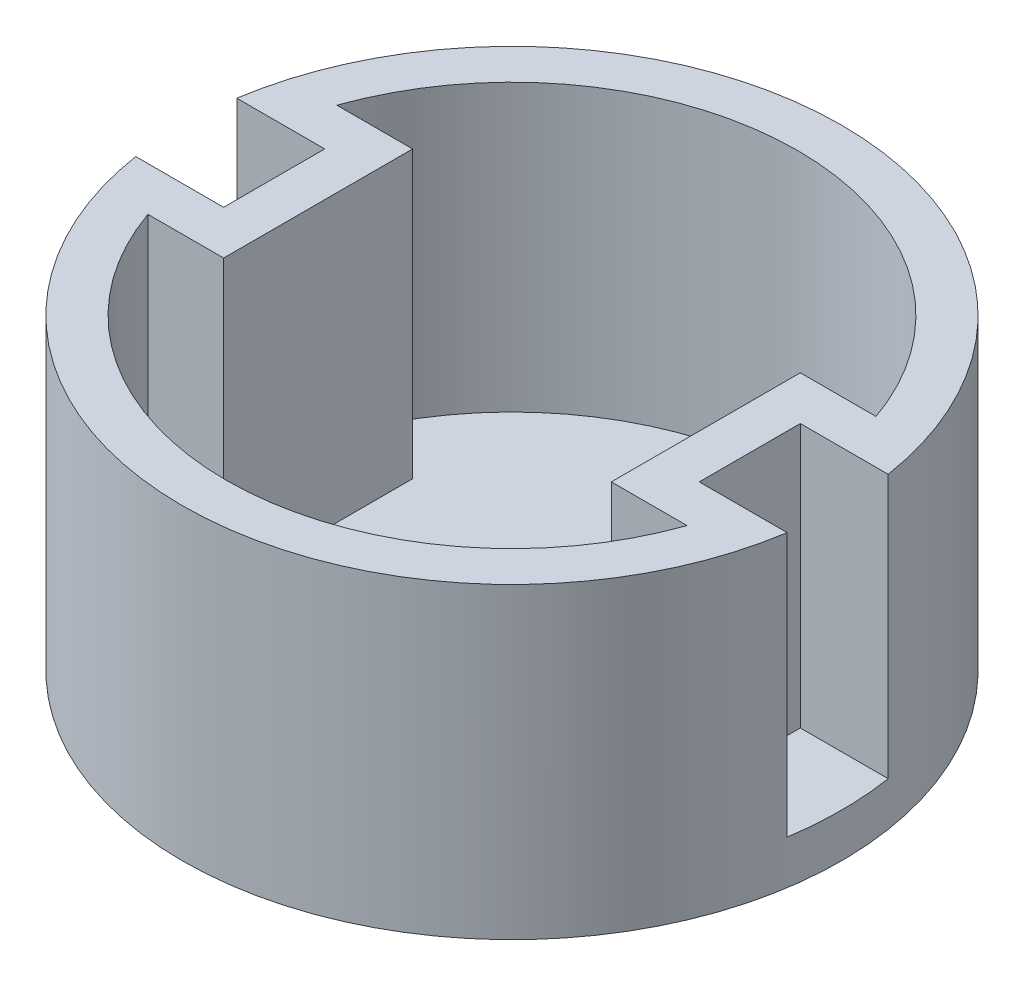
ISO-10303-21;
HEADER;
FILE_DESCRIPTION(('STEP AP214'),'2;1');
FILE_NAME('part.step','',(''),(''),'','','');
FILE_SCHEMA(('AUTOMOTIVE_DESIGN { 1 0 10303 214 1 1 1 1 }'));
ENDSEC;
DATA;
#1=APPLICATION_CONTEXT('core data for automotive mechanical design processes');
#2=APPLICATION_PROTOCOL_DEFINITION('international standard','automotive_design',2000,#1);
#3=PRODUCT_CONTEXT('',#1,'mechanical');
#4=PRODUCT('Part','Part','',(#3));
#5=PRODUCT_RELATED_PRODUCT_CATEGORY('part','',(#4));
#6=PRODUCT_DEFINITION_FORMATION('','',#4);
#7=PRODUCT_DEFINITION_CONTEXT('part definition',#1,'design');
#8=PRODUCT_DEFINITION('design','',#6,#7);
#9=PRODUCT_DEFINITION_SHAPE('','',#8);
#10=(LENGTH_UNIT() NAMED_UNIT(*) SI_UNIT(.MILLI.,.METRE.));
#11=(NAMED_UNIT(*) PLANE_ANGLE_UNIT() SI_UNIT($,.RADIAN.));
#12=(NAMED_UNIT(*) SI_UNIT($,.STERADIAN.) SOLID_ANGLE_UNIT());
#13=UNCERTAINTY_MEASURE_WITH_UNIT(LENGTH_MEASURE(1.E-05),#10,'distance_accuracy_value','');
#14=(GEOMETRIC_REPRESENTATION_CONTEXT(3) GLOBAL_UNCERTAINTY_ASSIGNED_CONTEXT((#13)) GLOBAL_UNIT_ASSIGNED_CONTEXT((#10,
#11,#12)) REPRESENTATION_CONTEXT('',''));
#15=CARTESIAN_POINT('',(0.,0.,0.));
#16=DIRECTION('',(0.,0.,1.));
#17=DIRECTION('',(1.,0.,0.));
#18=AXIS2_PLACEMENT_3D('',#15,#16,#17);
#19=CARTESIAN_POINT('',(-19.143760262746,5.,-2.85119833700473));
#20=DIRECTION('',(0.,1.,0.));
#21=DIRECTION('',(0.,0.,1.));
#22=AXIS2_PLACEMENT_3D('',#19,#20,#21);
#23=CYLINDRICAL_SURFACE('',#22,65.);
#24=DIRECTION('',(0.,-1.,0.));
#25=VECTOR('',#24,1.);
#26=CARTESIAN_POINT('',(42.1974982831952,70.,-24.3511983370047));
#27=LINE('',#26,#25);
#28=CARTESIAN_POINT('',(42.1974982831952,70.,-24.3511983370047));
#29=VERTEX_POINT('',#28);
#30=CARTESIAN_POINT('',(42.1974982831952,5.,-24.3511983370047));
#31=VERTEX_POINT('',#30);
#32=EDGE_CURVE('E136',#29,#31,#27,.T.);
#33=ORIENTED_EDGE('',*,*,#32,.F.);
#34=CARTESIAN_POINT('',(-19.143760262746,70.,-2.85119833700473));
#35=DIRECTION('',(0.,1.,0.));
#36=DIRECTION('',(0.,0.,1.));
#37=AXIS2_PLACEMENT_3D('',#34,#35,#36);
#38=CIRCLE('',#37,65.);
#39=CARTESIAN_POINT('',(-80.4850188086872,70.,-24.3511983370047));
#40=VERTEX_POINT('',#39);
#41=EDGE_CURVE('E247',#29,#40,#38,.T.);
#42=ORIENTED_EDGE('',*,*,#41,.T.);
#43=DIRECTION('',(0.,-1.,0.));
#44=VECTOR('',#43,1.);
#45=CARTESIAN_POINT('',(-80.4850188086872,70.,-24.3511983370047));
#46=LINE('',#45,#44);
#47=CARTESIAN_POINT('',(-80.4850188086872,5.,-24.3511983370047));
#48=VERTEX_POINT('',#47);
#49=EDGE_CURVE('E305',#40,#48,#46,.T.);
#50=ORIENTED_EDGE('',*,*,#49,.T.);
#51=CARTESIAN_POINT('',(-19.143760262746,5.,-2.85119833700473));
#52=DIRECTION('',(0.,1.,0.));
#53=DIRECTION('',(0.,0.,1.));
#54=AXIS2_PLACEMENT_3D('',#51,#52,#53);
#55=CIRCLE('',#54,65.);
#56=EDGE_CURVE('E364',#31,#48,#55,.T.);
#57=ORIENTED_EDGE('',*,*,#56,.F.);
#58=EDGE_LOOP('',(#33,#42,#50,#57));
#59=FACE_BOUND('',#58,.T.);
#60=ADVANCED_FACE('F111',(#59),#23,.F.);
#61=CARTESIAN_POINT('',(0.,5.,0.));
#62=DIRECTION('',(0.,1.,0.));
#63=DIRECTION('',(0.,0.,1.));
#64=AXIS2_PLACEMENT_3D('',#61,#62,#63);
#65=PLANE('',#64);
#66=DIRECTION('',(0.,0.,1.));
#67=VECTOR('',#66,1.);
#68=CARTESIAN_POINT('',(24.9693289995429,5.,0.));
#69=LINE('',#68,#67);
#70=CARTESIAN_POINT('',(24.9693289995429,5.,-24.3511983370047));
#71=VERTEX_POINT('',#70);
#72=CARTESIAN_POINT('',(24.9693289995429,5.,18.6488016629953));
#73=VERTEX_POINT('',#72);
#74=EDGE_CURVE('E388',#71,#73,#69,.T.);
#75=ORIENTED_EDGE('',*,*,#74,.F.);
#76=DIRECTION('',(-1.,0.,0.));
#77=VECTOR('',#76,1.);
#78=CARTESIAN_POINT('',(0.,5.,-24.3511983370047));
#79=LINE('',#78,#77);
#80=EDGE_CURVE('E253',#31,#71,#79,.T.);
#81=ORIENTED_EDGE('',*,*,#80,.F.);
#82=ORIENTED_EDGE('',*,*,#56,.T.);
#83=DIRECTION('',(1.,0.,0.));
#84=VECTOR('',#83,1.);
#85=CARTESIAN_POINT('',(0.,5.,-24.3511983370047));
#86=LINE('',#85,#84);
#87=CARTESIAN_POINT('',(-63.2568495250349,5.,-24.3511983370047));
#88=VERTEX_POINT('',#87);
#89=EDGE_CURVE('E255',#48,#88,#86,.T.);
#90=ORIENTED_EDGE('',*,*,#89,.T.);
#91=DIRECTION('',(0.,0.,1.));
#92=VECTOR('',#91,1.);
#93=CARTESIAN_POINT('',(-63.2568495250349,5.,0.));
#94=LINE('',#93,#92);
#95=CARTESIAN_POINT('',(-63.2568495250349,5.,18.6488016629953));
#96=VERTEX_POINT('',#95);
#97=EDGE_CURVE('E271',#88,#96,#94,.T.);
#98=ORIENTED_EDGE('',*,*,#97,.T.);
#99=DIRECTION('',(1.,0.,0.));
#100=VECTOR('',#99,1.);
#101=CARTESIAN_POINT('',(0.,5.,18.6488016629953));
#102=LINE('',#101,#100);
#103=CARTESIAN_POINT('',(-80.4850188086872,5.,18.6488016629953));
#104=VERTEX_POINT('',#103);
#105=EDGE_CURVE('E260',#104,#96,#102,.T.);
#106=ORIENTED_EDGE('',*,*,#105,.F.);
#107=CARTESIAN_POINT('',(42.1974982831952,5.,18.6488016629953));
#108=VERTEX_POINT('',#107);
#109=EDGE_CURVE('E367',#104,#108,#55,.T.);
#110=ORIENTED_EDGE('',*,*,#109,.T.);
#111=DIRECTION('',(-1.,0.,0.));
#112=VECTOR('',#111,1.);
#113=CARTESIAN_POINT('',(0.,5.,18.6488016629953));
#114=LINE('',#113,#112);
#115=EDGE_CURVE('E250',#108,#73,#114,.T.);
#116=ORIENTED_EDGE('',*,*,#115,.T.);
#117=EDGE_LOOP('',(#75,#81,#82,#90,#98,#106,#110,#116));
#118=FACE_BOUND('',#117,.T.);
#119=ADVANCED_FACE('F384',(#118),#65,.T.);
#120=CARTESIAN_POINT('',(-80.4850188086872,70.,18.6488016629953));
#121=VERTEX_POINT('',#120);
#122=CARTESIAN_POINT('',(42.1974982831952,70.,18.6488016629953));
#123=VERTEX_POINT('',#122);
#124=EDGE_CURVE('E128',#121,#123,#38,.T.);
#125=ORIENTED_EDGE('',*,*,#124,.T.);
#126=DIRECTION('',(0.,-1.,0.));
#127=VECTOR('',#126,1.);
#128=CARTESIAN_POINT('',(42.1974982831952,70.,18.6488016629953));
#129=LINE('',#128,#127);
#130=EDGE_CURVE('E262',#123,#108,#129,.T.);
#131=ORIENTED_EDGE('',*,*,#130,.T.);
#132=ORIENTED_EDGE('',*,*,#109,.F.);
#133=DIRECTION('',(0.,-1.,0.));
#134=VECTOR('',#133,1.);
#135=CARTESIAN_POINT('',(-80.4850188086872,70.,18.6488016629953));
#136=LINE('',#135,#134);
#137=EDGE_CURVE('E294',#121,#104,#136,.T.);
#138=ORIENTED_EDGE('',*,*,#137,.F.);
#139=EDGE_LOOP('',(#125,#131,#132,#138));
#140=FACE_BOUND('',#139,.T.);
#141=ADVANCED_FACE('F405',(#140),#23,.F.);
#142=CARTESIAN_POINT('',(-19.143760262746,70.,-2.85119833700473));
#143=DIRECTION('',(0.,-1.,0.));
#144=DIRECTION('',(0.,0.,-1.));
#145=AXIS2_PLACEMENT_3D('',#142,#143,#144);
#146=CYLINDRICAL_SURFACE('',#145,75.);
#147=CARTESIAN_POINT('',(-19.143760262746,0.,-2.85119833700473));
#148=DIRECTION('',(0.,1.,0.));
#149=DIRECTION('',(0.,0.,1.));
#150=AXIS2_PLACEMENT_3D('',#147,#148,#149);
#151=CIRCLE('',#150,75.);
#152=CARTESIAN_POINT('',(-19.143760262746,0.,72.1488016629953));
#153=VERTEX_POINT('',#152);
#154=EDGE_CURVE('E115',#153,#153,#151,.T.);
#155=ORIENTED_EDGE('',*,*,#154,.T.);
#156=EDGE_LOOP('',(#155));
#157=FACE_BOUND('',#156,.T.);
#158=DIRECTION('',(0.,-1.,0.));
#159=VECTOR('',#158,1.);
#160=CARTESIAN_POINT('',(-93.2568495250349,70.,-14.3511983370047));
#161=LINE('',#160,#159);
#162=CARTESIAN_POINT('',(-93.2568495250349,70.,-14.3511983370047));
#163=VERTEX_POINT('',#162);
#164=CARTESIAN_POINT('',(-93.2568495250349,10.,-14.3511983370047));
#165=VERTEX_POINT('',#164);
#166=EDGE_CURVE('E354',#163,#165,#161,.T.);
#167=ORIENTED_EDGE('',*,*,#166,.F.);
#168=CARTESIAN_POINT('',(-19.143760262746,70.,-2.85119833700473));
#169=DIRECTION('',(0.,1.,0.));
#170=DIRECTION('',(0.,0.,1.));
#171=AXIS2_PLACEMENT_3D('',#168,#169,#170);
#172=CIRCLE('',#171,75.);
#173=CARTESIAN_POINT('',(54.9693289995429,70.,-14.3511983370047));
#174=VERTEX_POINT('',#173);
#175=EDGE_CURVE('E12',#174,#163,#172,.T.);
#176=ORIENTED_EDGE('',*,*,#175,.F.);
#177=DIRECTION('',(0.,-1.,0.));
#178=VECTOR('',#177,1.);
#179=CARTESIAN_POINT('',(54.9693289995429,70.,-14.3511983370047));
#180=LINE('',#179,#178);
#181=CARTESIAN_POINT('',(54.9693289995429,10.,-14.3511983370047));
#182=VERTEX_POINT('',#181);
#183=EDGE_CURVE('E347',#174,#182,#180,.T.);
#184=ORIENTED_EDGE('',*,*,#183,.T.);
#185=CARTESIAN_POINT('',(-19.143760262746,10.,-2.85119833700473));
#186=DIRECTION('',(0.,1.,0.));
#187=DIRECTION('',(0.,0.,1.));
#188=AXIS2_PLACEMENT_3D('',#185,#186,#187);
#189=CIRCLE('',#188,75.);
#190=CARTESIAN_POINT('',(54.9693289995429,10.,8.64880166299527));
#191=VERTEX_POINT('',#190);
#192=EDGE_CURVE('E321',#191,#182,#189,.T.);
#193=ORIENTED_EDGE('',*,*,#192,.F.);
#194=DIRECTION('',(0.,-1.,0.));
#195=VECTOR('',#194,1.);
#196=CARTESIAN_POINT('',(54.9693289995429,70.,8.64880166299527));
#197=LINE('',#196,#195);
#198=CARTESIAN_POINT('',(54.9693289995429,70.,8.64880166299527));
#199=VERTEX_POINT('',#198);
#200=EDGE_CURVE('E361',#199,#191,#197,.T.);
#201=ORIENTED_EDGE('',*,*,#200,.F.);
#202=CARTESIAN_POINT('',(-93.2568495250349,70.,8.64880166299527));
#203=VERTEX_POINT('',#202);
#204=EDGE_CURVE('E121',#203,#199,#172,.T.);
#205=ORIENTED_EDGE('',*,*,#204,.F.);
#206=DIRECTION('',(0.,-1.,0.));
#207=VECTOR('',#206,1.);
#208=CARTESIAN_POINT('',(-93.2568495250349,70.,8.64880166299527));
#209=LINE('',#208,#207);
#210=CARTESIAN_POINT('',(-93.2568495250349,10.,8.64880166299527));
#211=VERTEX_POINT('',#210);
#212=EDGE_CURVE('E357',#203,#211,#209,.T.);
#213=ORIENTED_EDGE('',*,*,#212,.T.);
#214=CARTESIAN_POINT('',(-19.143760262746,10.,-2.85119833700473));
#215=DIRECTION('',(0.,1.,0.));
#216=DIRECTION('',(0.,0.,1.));
#217=AXIS2_PLACEMENT_3D('',#214,#215,#216);
#218=CIRCLE('',#217,75.);
#219=EDGE_CURVE('E351',#165,#211,#218,.T.);
#220=ORIENTED_EDGE('',*,*,#219,.F.);
#221=EDGE_LOOP('',(#167,#176,#184,#193,#201,#205,#213,#220));
#222=FACE_BOUND('',#221,.T.);
#223=ADVANCED_FACE('F113',(#157,#222),#146,.T.);
#224=CARTESIAN_POINT('',(-19.143760262746,70.,-2.85119833700473));
#225=DIRECTION('',(0.,1.,0.));
#226=DIRECTION('',(0.,0.,1.));
#227=AXIS2_PLACEMENT_3D('',#224,#225,#226);
#228=PLANE('',#227);
#229=DIRECTION('',(1.,0.,0.));
#230=VECTOR('',#229,1.);
#231=CARTESIAN_POINT('',(54.9693289995429,70.,8.64880166299527));
#232=LINE('',#231,#230);
#233=CARTESIAN_POINT('',(34.9693289995429,70.,8.64880166299528));
#234=VERTEX_POINT('',#233);
#235=EDGE_CURVE('E325',#234,#199,#232,.T.);
#236=ORIENTED_EDGE('',*,*,#235,.F.);
#237=DIRECTION('',(0.,0.,1.));
#238=VECTOR('',#237,1.);
#239=CARTESIAN_POINT('',(34.9693289995429,70.,0.));
#240=LINE('',#239,#238);
#241=CARTESIAN_POINT('',(34.9693289995429,70.,-14.3511983370047));
#242=VERTEX_POINT('',#241);
#243=EDGE_CURVE('E397',#242,#234,#240,.T.);
#244=ORIENTED_EDGE('',*,*,#243,.F.);
#245=DIRECTION('',(1.,0.,0.));
#246=VECTOR('',#245,1.);
#247=CARTESIAN_POINT('',(54.9693289995429,70.,-14.3511983370047));
#248=LINE('',#247,#246);
#249=EDGE_CURVE('E328',#242,#174,#248,.T.);
#250=ORIENTED_EDGE('',*,*,#249,.T.);
#251=ORIENTED_EDGE('',*,*,#175,.T.);
#252=DIRECTION('',(1.,0.,0.));
#253=VECTOR('',#252,1.);
#254=CARTESIAN_POINT('',(0.,70.,-14.3511983370047));
#255=LINE('',#254,#253);
#256=CARTESIAN_POINT('',(-73.2568495250349,70.,-14.3511983370047));
#257=VERTEX_POINT('',#256);
#258=EDGE_CURVE('E322',#163,#257,#255,.T.);
#259=ORIENTED_EDGE('',*,*,#258,.T.);
#260=DIRECTION('',(0.,0.,-1.));
#261=VECTOR('',#260,1.);
#262=CARTESIAN_POINT('',(-73.2568495250349,70.,0.));
#263=LINE('',#262,#261);
#264=CARTESIAN_POINT('',(-73.2568495250349,70.,8.64880166299527));
#265=VERTEX_POINT('',#264);
#266=EDGE_CURVE('E270',#265,#257,#263,.T.);
#267=ORIENTED_EDGE('',*,*,#266,.F.);
#268=DIRECTION('',(1.,0.,0.));
#269=VECTOR('',#268,1.);
#270=CARTESIAN_POINT('',(0.,70.,8.64880166299527));
#271=LINE('',#270,#269);
#272=EDGE_CURVE('E314',#203,#265,#271,.T.);
#273=ORIENTED_EDGE('',*,*,#272,.F.);
#274=ORIENTED_EDGE('',*,*,#204,.T.);
#275=EDGE_LOOP('',(#236,#244,#250,#251,#259,#267,#273,#274));
#276=FACE_BOUND('',#275,.T.);
#277=DIRECTION('',(-1.,0.,0.));
#278=VECTOR('',#277,1.);
#279=CARTESIAN_POINT('',(0.,70.,18.6488016629953));
#280=LINE('',#279,#278);
#281=CARTESIAN_POINT('',(24.9693289995429,70.,18.6488016629953));
#282=VERTEX_POINT('',#281);
#283=EDGE_CURVE('E241',#123,#282,#280,.T.);
#284=ORIENTED_EDGE('',*,*,#283,.F.);
#285=ORIENTED_EDGE('',*,*,#124,.F.);
#286=DIRECTION('',(1.,0.,0.));
#287=VECTOR('',#286,1.);
#288=CARTESIAN_POINT('',(0.,70.,18.6488016629953));
#289=LINE('',#288,#287);
#290=CARTESIAN_POINT('',(-63.2568495250349,70.,18.6488016629953));
#291=VERTEX_POINT('',#290);
#292=EDGE_CURVE('E275',#121,#291,#289,.T.);
#293=ORIENTED_EDGE('',*,*,#292,.T.);
#294=DIRECTION('',(0.,0.,1.));
#295=VECTOR('',#294,1.);
#296=CARTESIAN_POINT('',(-63.2568495250349,70.,0.));
#297=LINE('',#296,#295);
#298=CARTESIAN_POINT('',(-63.2568495250349,70.,-24.3511983370047));
#299=VERTEX_POINT('',#298);
#300=EDGE_CURVE('E278',#299,#291,#297,.T.);
#301=ORIENTED_EDGE('',*,*,#300,.F.);
#302=DIRECTION('',(1.,0.,0.));
#303=VECTOR('',#302,1.);
#304=CARTESIAN_POINT('',(0.,70.,-24.3511983370047));
#305=LINE('',#304,#303);
#306=EDGE_CURVE('E266',#40,#299,#305,.T.);
#307=ORIENTED_EDGE('',*,*,#306,.F.);
#308=ORIENTED_EDGE('',*,*,#41,.F.);
#309=DIRECTION('',(-1.,0.,0.));
#310=VECTOR('',#309,1.);
#311=CARTESIAN_POINT('',(0.,70.,-24.3511983370047));
#312=LINE('',#311,#310);
#313=CARTESIAN_POINT('',(24.9693289995429,70.,-24.3511983370047));
#314=VERTEX_POINT('',#313);
#315=EDGE_CURVE('E242',#29,#314,#312,.T.);
#316=ORIENTED_EDGE('',*,*,#315,.T.);
#317=DIRECTION('',(0.,0.,1.));
#318=VECTOR('',#317,1.);
#319=CARTESIAN_POINT('',(24.9693289995429,70.,0.));
#320=LINE('',#319,#318);
#321=EDGE_CURVE('E228',#314,#282,#320,.T.);
#322=ORIENTED_EDGE('',*,*,#321,.T.);
#323=EDGE_LOOP('',(#284,#285,#293,#301,#307,#308,#316,#322));
#324=FACE_BOUND('',#323,.T.);
#325=ADVANCED_FACE('F245',(#276,#324),#228,.T.);
#326=CARTESIAN_POINT('',(-19.143760262746,0.,-2.85119833700473));
#327=DIRECTION('',(0.,1.,0.));
#328=DIRECTION('',(0.,0.,1.));
#329=AXIS2_PLACEMENT_3D('',#326,#327,#328);
#330=PLANE('',#329);
#331=ORIENTED_EDGE('',*,*,#154,.F.);
#332=EDGE_LOOP('',(#331));
#333=FACE_BOUND('',#332,.T.);
#334=ADVANCED_FACE('F581',(#333),#330,.F.);
#335=CARTESIAN_POINT('',(0.,10.,8.64880166299528));
#336=DIRECTION('',(0.,0.,-1.));
#337=DIRECTION('',(-1.,0.,0.));
#338=AXIS2_PLACEMENT_3D('',#335,#336,#337);
#339=PLANE('',#338);
#340=ORIENTED_EDGE('',*,*,#200,.T.);
#341=DIRECTION('',(1.,0.,0.));
#342=VECTOR('',#341,1.);
#343=CARTESIAN_POINT('',(54.9693289995429,10.,8.64880166299527));
#344=LINE('',#343,#342);
#345=CARTESIAN_POINT('',(34.9693289995429,10.,8.64880166299528));
#346=VERTEX_POINT('',#345);
#347=EDGE_CURVE('E332',#346,#191,#344,.T.);
#348=ORIENTED_EDGE('',*,*,#347,.F.);
#349=DIRECTION('',(0.,-1.,0.));
#350=VECTOR('',#349,1.);
#351=CARTESIAN_POINT('',(34.9693289995429,70.,8.64880166299528));
#352=LINE('',#351,#350);
#353=EDGE_CURVE('E401',#234,#346,#352,.T.);
#354=ORIENTED_EDGE('',*,*,#353,.F.);
#355=ORIENTED_EDGE('',*,*,#235,.T.);
#356=EDGE_LOOP('',(#340,#348,#354,#355));
#357=FACE_BOUND('',#356,.T.);
#358=ADVANCED_FACE('F577',(#357),#339,.T.);
#359=CARTESIAN_POINT('',(0.,10.,-14.3511983370047));
#360=DIRECTION('',(0.,0.,-1.));
#361=DIRECTION('',(-1.,0.,0.));
#362=AXIS2_PLACEMENT_3D('',#359,#360,#361);
#363=PLANE('',#362);
#364=ORIENTED_EDGE('',*,*,#249,.F.);
#365=DIRECTION('',(0.,-1.,0.));
#366=VECTOR('',#365,1.);
#367=CARTESIAN_POINT('',(34.9693289995429,70.,-14.3511983370047));
#368=LINE('',#367,#366);
#369=CARTESIAN_POINT('',(34.9693289995429,10.,-14.3511983370047));
#370=VERTEX_POINT('',#369);
#371=EDGE_CURVE('E396',#242,#370,#368,.T.);
#372=ORIENTED_EDGE('',*,*,#371,.T.);
#373=DIRECTION('',(1.,0.,0.));
#374=VECTOR('',#373,1.);
#375=CARTESIAN_POINT('',(54.9693289995429,10.,-14.3511983370047));
#376=LINE('',#375,#374);
#377=EDGE_CURVE('E335',#370,#182,#376,.T.);
#378=ORIENTED_EDGE('',*,*,#377,.T.);
#379=ORIENTED_EDGE('',*,*,#183,.F.);
#380=EDGE_LOOP('',(#364,#372,#378,#379));
#381=FACE_BOUND('',#380,.T.);
#382=ADVANCED_FACE('F580',(#381),#363,.F.);
#383=CARTESIAN_POINT('',(0.,10.,0.));
#384=DIRECTION('',(0.,1.,0.));
#385=DIRECTION('',(0.,0.,1.));
#386=AXIS2_PLACEMENT_3D('',#383,#384,#385);
#387=PLANE('',#386);
#388=ORIENTED_EDGE('',*,*,#192,.T.);
#389=ORIENTED_EDGE('',*,*,#377,.F.);
#390=DIRECTION('',(0.,0.,1.));
#391=VECTOR('',#390,1.);
#392=CARTESIAN_POINT('',(34.9693289995429,10.,0.));
#393=LINE('',#392,#391);
#394=EDGE_CURVE('E309',#370,#346,#393,.T.);
#395=ORIENTED_EDGE('',*,*,#394,.T.);
#396=ORIENTED_EDGE('',*,*,#347,.T.);
#397=EDGE_LOOP('',(#388,#389,#395,#396));
#398=FACE_BOUND('',#397,.T.);
#399=ADVANCED_FACE('F473',(#398),#387,.T.);
#400=CARTESIAN_POINT('',(0.,10.,8.64880166299527));
#401=DIRECTION('',(0.,0.,1.));
#402=DIRECTION('',(1.,0.,0.));
#403=AXIS2_PLACEMENT_3D('',#400,#401,#402);
#404=PLANE('',#403);
#405=ORIENTED_EDGE('',*,*,#272,.T.);
#406=DIRECTION('',(0.,-1.,0.));
#407=VECTOR('',#406,1.);
#408=CARTESIAN_POINT('',(-73.2568495250349,70.,8.64880166299527));
#409=LINE('',#408,#407);
#410=CARTESIAN_POINT('',(-73.2568495250349,10.,8.64880166299527));
#411=VERTEX_POINT('',#410);
#412=EDGE_CURVE('E297',#265,#411,#409,.T.);
#413=ORIENTED_EDGE('',*,*,#412,.T.);
#414=DIRECTION('',(1.,0.,0.));
#415=VECTOR('',#414,1.);
#416=CARTESIAN_POINT('',(0.,10.,8.64880166299527));
#417=LINE('',#416,#415);
#418=EDGE_CURVE('E313',#211,#411,#417,.T.);
#419=ORIENTED_EDGE('',*,*,#418,.F.);
#420=ORIENTED_EDGE('',*,*,#212,.F.);
#421=EDGE_LOOP('',(#405,#413,#419,#420));
#422=FACE_BOUND('',#421,.T.);
#423=ADVANCED_FACE('F454',(#422),#404,.F.);
#424=CARTESIAN_POINT('',(0.,10.,-14.3511983370047));
#425=DIRECTION('',(0.,0.,1.));
#426=DIRECTION('',(1.,0.,0.));
#427=AXIS2_PLACEMENT_3D('',#424,#425,#426);
#428=PLANE('',#427);
#429=ORIENTED_EDGE('',*,*,#166,.T.);
#430=DIRECTION('',(1.,0.,0.));
#431=VECTOR('',#430,1.);
#432=CARTESIAN_POINT('',(0.,10.,-14.3511983370047));
#433=LINE('',#432,#431);
#434=CARTESIAN_POINT('',(-73.2568495250349,10.,-14.3511983370047));
#435=VERTEX_POINT('',#434);
#436=EDGE_CURVE('E310',#165,#435,#433,.T.);
#437=ORIENTED_EDGE('',*,*,#436,.T.);
#438=DIRECTION('',(0.,-1.,0.));
#439=VECTOR('',#438,1.);
#440=CARTESIAN_POINT('',(-73.2568495250349,70.,-14.3511983370047));
#441=LINE('',#440,#439);
#442=EDGE_CURVE('E301',#257,#435,#441,.T.);
#443=ORIENTED_EDGE('',*,*,#442,.F.);
#444=ORIENTED_EDGE('',*,*,#258,.F.);
#445=EDGE_LOOP('',(#429,#437,#443,#444));
#446=FACE_BOUND('',#445,.T.);
#447=ADVANCED_FACE('F444',(#446),#428,.T.);
#448=CARTESIAN_POINT('',(0.,10.,0.));
#449=DIRECTION('',(0.,1.,0.));
#450=DIRECTION('',(0.,0.,1.));
#451=AXIS2_PLACEMENT_3D('',#448,#449,#450);
#452=PLANE('',#451);
#453=ORIENTED_EDGE('',*,*,#219,.T.);
#454=ORIENTED_EDGE('',*,*,#418,.T.);
#455=DIRECTION('',(0.,0.,1.));
#456=VECTOR('',#455,1.);
#457=CARTESIAN_POINT('',(-73.2568495250349,10.,0.));
#458=LINE('',#457,#456);
#459=EDGE_CURVE('E317',#435,#411,#458,.T.);
#460=ORIENTED_EDGE('',*,*,#459,.F.);
#461=ORIENTED_EDGE('',*,*,#436,.F.);
#462=EDGE_LOOP('',(#453,#454,#460,#461));
#463=FACE_BOUND('',#462,.T.);
#464=ADVANCED_FACE('F438',(#463),#452,.T.);
#465=CARTESIAN_POINT('',(0.,70.,-24.3511983370047));
#466=DIRECTION('',(0.,0.,-1.));
#467=DIRECTION('',(-1.,0.,0.));
#468=AXIS2_PLACEMENT_3D('',#465,#466,#467);
#469=PLANE('',#468);
#470=ORIENTED_EDGE('',*,*,#89,.F.);
#471=ORIENTED_EDGE('',*,*,#49,.F.);
#472=ORIENTED_EDGE('',*,*,#306,.T.);
#473=DIRECTION('',(0.,-1.,0.));
#474=VECTOR('',#473,1.);
#475=CARTESIAN_POINT('',(-63.2568495250349,70.,-24.3511983370047));
#476=LINE('',#475,#474);
#477=EDGE_CURVE('E281',#299,#88,#476,.T.);
#478=ORIENTED_EDGE('',*,*,#477,.T.);
#479=EDGE_LOOP('',(#470,#471,#472,#478));
#480=FACE_BOUND('',#479,.T.);
#481=ADVANCED_FACE('F443',(#480),#469,.T.);
#482=CARTESIAN_POINT('',(-73.2568495250349,70.,0.));
#483=DIRECTION('',(-1.,0.,0.));
#484=DIRECTION('',(0.,0.,1.));
#485=AXIS2_PLACEMENT_3D('',#482,#483,#484);
#486=PLANE('',#485);
#487=ORIENTED_EDGE('',*,*,#442,.T.);
#488=ORIENTED_EDGE('',*,*,#459,.T.);
#489=ORIENTED_EDGE('',*,*,#412,.F.);
#490=ORIENTED_EDGE('',*,*,#266,.T.);
#491=EDGE_LOOP('',(#487,#488,#489,#490));
#492=FACE_BOUND('',#491,.T.);
#493=ADVANCED_FACE('F494',(#492),#486,.T.);
#494=CARTESIAN_POINT('',(0.,70.,18.6488016629953));
#495=DIRECTION('',(0.,0.,-1.));
#496=DIRECTION('',(-1.,0.,0.));
#497=AXIS2_PLACEMENT_3D('',#494,#495,#496);
#498=PLANE('',#497);
#499=ORIENTED_EDGE('',*,*,#105,.T.);
#500=DIRECTION('',(0.,-1.,0.));
#501=VECTOR('',#500,1.);
#502=CARTESIAN_POINT('',(-63.2568495250349,70.,18.6488016629953));
#503=LINE('',#502,#501);
#504=EDGE_CURVE('E291',#291,#96,#503,.T.);
#505=ORIENTED_EDGE('',*,*,#504,.F.);
#506=ORIENTED_EDGE('',*,*,#292,.F.);
#507=ORIENTED_EDGE('',*,*,#137,.T.);
#508=EDGE_LOOP('',(#499,#505,#506,#507));
#509=FACE_BOUND('',#508,.T.);
#510=ADVANCED_FACE('F505',(#509),#498,.F.);
#511=CARTESIAN_POINT('',(-63.2568495250349,70.,0.));
#512=DIRECTION('',(1.,0.,0.));
#513=DIRECTION('',(0.,0.,-1.));
#514=AXIS2_PLACEMENT_3D('',#511,#512,#513);
#515=PLANE('',#514);
#516=ORIENTED_EDGE('',*,*,#97,.F.);
#517=ORIENTED_EDGE('',*,*,#477,.F.);
#518=ORIENTED_EDGE('',*,*,#300,.T.);
#519=ORIENTED_EDGE('',*,*,#504,.T.);
#520=EDGE_LOOP('',(#516,#517,#518,#519));
#521=FACE_BOUND('',#520,.T.);
#522=ADVANCED_FACE('F517',(#521),#515,.T.);
#523=CARTESIAN_POINT('',(0.,70.,-24.3511983370047));
#524=DIRECTION('',(0.,0.,1.));
#525=DIRECTION('',(1.,0.,0.));
#526=AXIS2_PLACEMENT_3D('',#523,#524,#525);
#527=PLANE('',#526);
#528=ORIENTED_EDGE('',*,*,#80,.T.);
#529=DIRECTION('',(0.,-1.,0.));
#530=VECTOR('',#529,1.);
#531=CARTESIAN_POINT('',(24.9693289995429,70.,-24.3511983370047));
#532=LINE('',#531,#530);
#533=EDGE_CURVE('E233',#314,#71,#532,.T.);
#534=ORIENTED_EDGE('',*,*,#533,.F.);
#535=ORIENTED_EDGE('',*,*,#315,.F.);
#536=ORIENTED_EDGE('',*,*,#32,.T.);
#537=EDGE_LOOP('',(#528,#534,#535,#536));
#538=FACE_BOUND('',#537,.T.);
#539=ADVANCED_FACE('F252',(#538),#527,.F.);
#540=CARTESIAN_POINT('',(24.9693289995429,70.,0.));
#541=DIRECTION('',(1.,0.,0.));
#542=DIRECTION('',(0.,0.,-1.));
#543=AXIS2_PLACEMENT_3D('',#540,#541,#542);
#544=PLANE('',#543);
#545=ORIENTED_EDGE('',*,*,#74,.T.);
#546=DIRECTION('',(0.,-1.,0.));
#547=VECTOR('',#546,1.);
#548=CARTESIAN_POINT('',(24.9693289995429,70.,18.6488016629953));
#549=LINE('',#548,#547);
#550=EDGE_CURVE('E236',#282,#73,#549,.T.);
#551=ORIENTED_EDGE('',*,*,#550,.F.);
#552=ORIENTED_EDGE('',*,*,#321,.F.);
#553=ORIENTED_EDGE('',*,*,#533,.T.);
#554=EDGE_LOOP('',(#545,#551,#552,#553));
#555=FACE_BOUND('',#554,.T.);
#556=ADVANCED_FACE('F231',(#555),#544,.F.);
#557=CARTESIAN_POINT('',(0.,70.,18.6488016629953));
#558=DIRECTION('',(0.,0.,1.));
#559=DIRECTION('',(1.,0.,0.));
#560=AXIS2_PLACEMENT_3D('',#557,#558,#559);
#561=PLANE('',#560);
#562=ORIENTED_EDGE('',*,*,#115,.F.);
#563=ORIENTED_EDGE('',*,*,#130,.F.);
#564=ORIENTED_EDGE('',*,*,#283,.T.);
#565=ORIENTED_EDGE('',*,*,#550,.T.);
#566=EDGE_LOOP('',(#562,#563,#564,#565));
#567=FACE_BOUND('',#566,.T.);
#568=ADVANCED_FACE('F386',(#567),#561,.T.);
#569=CARTESIAN_POINT('',(34.9693289995429,70.,0.));
#570=DIRECTION('',(1.,0.,0.));
#571=DIRECTION('',(0.,0.,-1.));
#572=AXIS2_PLACEMENT_3D('',#569,#570,#571);
#573=PLANE('',#572);
#574=ORIENTED_EDGE('',*,*,#353,.T.);
#575=ORIENTED_EDGE('',*,*,#394,.F.);
#576=ORIENTED_EDGE('',*,*,#371,.F.);
#577=ORIENTED_EDGE('',*,*,#243,.T.);
#578=EDGE_LOOP('',(#574,#575,#576,#577));
#579=FACE_BOUND('',#578,.T.);
#580=ADVANCED_FACE('F554',(#579),#573,.T.);
#581=CLOSED_SHELL('',(#60,#119,#141,#223,#325,#334,#358,#382,#399,#423,#447,#464,#481,#493,#510,
#522,#539,#556,#568,#580));
#582=MANIFOLD_SOLID_BREP('B2',#581);
#583=ADVANCED_BREP_SHAPE_REPRESENTATION('',(#18,#582),#14);
#584=SHAPE_DEFINITION_REPRESENTATION(#9,#583);
ENDSEC;
END-ISO-10303-21;
